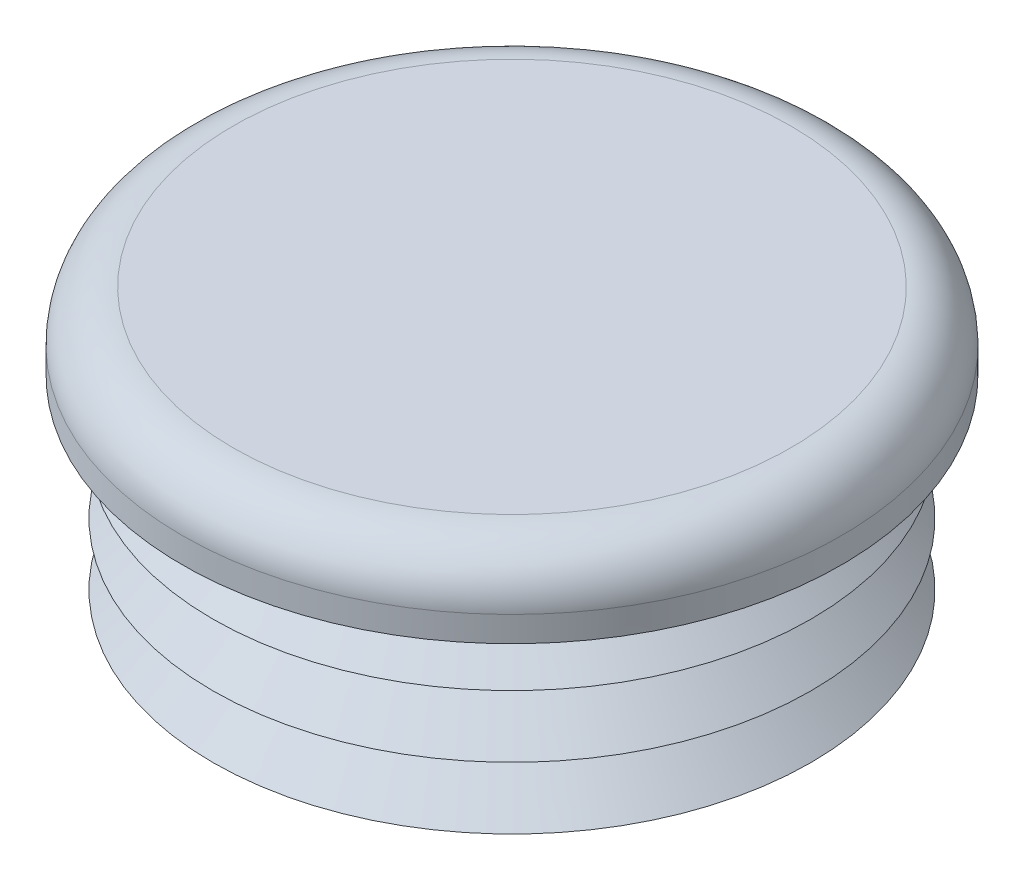
ISO-10303-21;
HEADER;
FILE_DESCRIPTION(('STEP AP214'),'2;1');
FILE_NAME('part.step','',(''),(''),'','','');
FILE_SCHEMA(('AUTOMOTIVE_DESIGN { 1 0 10303 214 1 1 1 1 }'));
ENDSEC;
DATA;
#1=APPLICATION_CONTEXT('core data for automotive mechanical design processes');
#2=APPLICATION_PROTOCOL_DEFINITION('international standard','automotive_design',2000,#1);
#3=PRODUCT_CONTEXT('',#1,'mechanical');
#4=PRODUCT('Part','Part','',(#3));
#5=PRODUCT_RELATED_PRODUCT_CATEGORY('part','',(#4));
#6=PRODUCT_DEFINITION_FORMATION('','',#4);
#7=PRODUCT_DEFINITION_CONTEXT('part definition',#1,'design');
#8=PRODUCT_DEFINITION('design','',#6,#7);
#9=PRODUCT_DEFINITION_SHAPE('','',#8);
#10=(LENGTH_UNIT() NAMED_UNIT(*) SI_UNIT(.MILLI.,.METRE.));
#11=(NAMED_UNIT(*) PLANE_ANGLE_UNIT() SI_UNIT($,.RADIAN.));
#12=(NAMED_UNIT(*) SI_UNIT($,.STERADIAN.) SOLID_ANGLE_UNIT());
#13=UNCERTAINTY_MEASURE_WITH_UNIT(LENGTH_MEASURE(1.E-05),#10,'distance_accuracy_value','');
#14=(GEOMETRIC_REPRESENTATION_CONTEXT(3) GLOBAL_UNCERTAINTY_ASSIGNED_CONTEXT((#13)) GLOBAL_UNIT_ASSIGNED_CONTEXT((#10,
#11,#12)) REPRESENTATION_CONTEXT('',''));
#15=CARTESIAN_POINT('',(0.,0.,0.));
#16=DIRECTION('',(0.,0.,1.));
#17=DIRECTION('',(1.,0.,0.));
#18=AXIS2_PLACEMENT_3D('',#15,#16,#17);
#19=CARTESIAN_POINT('',(0.,12.7,0.));
#20=DIRECTION('',(0.,-1.,0.));
#21=DIRECTION('',(0.,0.,-1.));
#22=AXIS2_PLACEMENT_3D('',#19,#20,#21);
#23=PLANE('',#22);
#24=CARTESIAN_POINT('',(0.,12.7,0.));
#25=DIRECTION('',(0.,-1.,0.));
#26=DIRECTION('',(0.,0.,-1.));
#27=AXIS2_PLACEMENT_3D('',#24,#25,#26);
#28=CIRCLE('',#27,14.9225);
#29=CARTESIAN_POINT('',(0.,12.7,-14.9225));
#30=VERTEX_POINT('',#29);
#31=EDGE_CURVE('E44',#30,#30,#28,.T.);
#32=ORIENTED_EDGE('',*,*,#31,.T.);
#33=EDGE_LOOP('',(#32));
#34=FACE_BOUND('',#33,.T.);
#35=ADVANCED_FACE('F33',(#34),#23,.T.);
#36=CARTESIAN_POINT('',(0.,0.,0.));
#37=DIRECTION('',(0.,-1.,0.));
#38=DIRECTION('',(0.,0.,-1.));
#39=AXIS2_PLACEMENT_3D('',#36,#37,#38);
#40=CYLINDRICAL_SURFACE('',#39,14.9225);
#41=CARTESIAN_POINT('',(0.,0.,0.));
#42=DIRECTION('',(0.,-1.,0.));
#43=DIRECTION('',(0.,0.,-1.));
#44=AXIS2_PLACEMENT_3D('',#41,#42,#43);
#45=CIRCLE('',#44,14.9225);
#46=CARTESIAN_POINT('',(0.,0.,-14.9225));
#47=VERTEX_POINT('',#46);
#48=EDGE_CURVE('E48',#47,#47,#45,.T.);
#49=ORIENTED_EDGE('',*,*,#48,.T.);
#50=EDGE_LOOP('',(#49));
#51=FACE_BOUND('',#50,.T.);
#52=ORIENTED_EDGE('',*,*,#31,.F.);
#53=EDGE_LOOP('',(#52));
#54=FACE_BOUND('',#53,.T.);
#55=ADVANCED_FACE('F105',(#51,#54),#40,.F.);
#56=CARTESIAN_POINT('',(14.9225,0.,0.));
#57=DIRECTION('',(0.,-1.,0.));
#58=DIRECTION('',(0.,0.,-1.));
#59=AXIS2_PLACEMENT_3D('',#56,#57,#58);
#60=PLANE('',#59);
#61=CARTESIAN_POINT('',(0.,0.,0.));
#62=DIRECTION('',(0.,-1.,0.));
#63=DIRECTION('',(0.,0.,-1.));
#64=AXIS2_PLACEMENT_3D('',#61,#62,#63);
#65=CIRCLE('',#64,15.875);
#66=CARTESIAN_POINT('',(0.,0.,-15.875));
#67=VERTEX_POINT('',#66);
#68=EDGE_CURVE('E53',#67,#67,#65,.T.);
#69=ORIENTED_EDGE('',*,*,#68,.T.);
#70=EDGE_LOOP('',(#69));
#71=FACE_BOUND('',#70,.T.);
#72=ORIENTED_EDGE('',*,*,#48,.F.);
#73=EDGE_LOOP('',(#72));
#74=FACE_BOUND('',#73,.T.);
#75=ADVANCED_FACE('F110',(#71,#74),#60,.T.);
#76=CARTESIAN_POINT('',(0.,0.,0.));
#77=DIRECTION('',(0.,-1.,0.));
#78=DIRECTION('',(0.,0.,-1.));
#79=AXIS2_PLACEMENT_3D('',#76,#77,#78);
#80=CYLINDRICAL_SURFACE('',#79,15.875);
#81=CARTESIAN_POINT('',(0.,1.03187500000004,0.));
#82=DIRECTION('',(0.,-1.,0.));
#83=DIRECTION('',(0.,0.,-1.));
#84=AXIS2_PLACEMENT_3D('',#81,#82,#83);
#85=CIRCLE('',#84,15.875);
#86=CARTESIAN_POINT('',(0.,1.03187500000004,-15.875));
#87=VERTEX_POINT('',#86);
#88=EDGE_CURVE('E56',#87,#87,#85,.T.);
#89=ORIENTED_EDGE('',*,*,#88,.T.);
#90=EDGE_LOOP('',(#89));
#91=FACE_BOUND('',#90,.T.);
#92=ORIENTED_EDGE('',*,*,#68,.F.);
#93=EDGE_LOOP('',(#92));
#94=FACE_BOUND('',#93,.T.);
#95=ADVANCED_FACE('F116',(#91,#94),#80,.T.);
#96=CARTESIAN_POINT('',(15.875,1.03187500000004,0.));
#97=DIRECTION('',(0.,-1.,0.));
#98=DIRECTION('',(0.,0.,-1.));
#99=AXIS2_PLACEMENT_3D('',#96,#97,#98);
#100=PLANE('',#99);
#101=CARTESIAN_POINT('',(0.,1.03187500000004,0.));
#102=DIRECTION('',(0.,-1.,0.));
#103=DIRECTION('',(0.,0.,-1.));
#104=AXIS2_PLACEMENT_3D('',#101,#102,#103);
#105=CIRCLE('',#104,18.7325);
#106=CARTESIAN_POINT('',(0.,1.03187500000004,-18.7325));
#107=VERTEX_POINT('',#106);
#108=EDGE_CURVE('E59',#107,#107,#105,.T.);
#109=ORIENTED_EDGE('',*,*,#108,.T.);
#110=EDGE_LOOP('',(#109));
#111=FACE_BOUND('',#110,.T.);
#112=ORIENTED_EDGE('',*,*,#88,.F.);
#113=EDGE_LOOP('',(#112));
#114=FACE_BOUND('',#113,.T.);
#115=ADVANCED_FACE('F120',(#111,#114),#100,.T.);
#116=CARTESIAN_POINT('',(0.,1.03187500000004,0.));
#117=DIRECTION('',(0.,-1.,0.));
#118=DIRECTION('',(0.,0.,-1.));
#119=AXIS2_PLACEMENT_3D('',#116,#117,#118);
#120=CONICAL_SURFACE('',#119,18.7325,0.785398163397457);
#121=CARTESIAN_POINT('',(0.,3.88937499999999,0.));
#122=DIRECTION('',(0.,-1.,0.));
#123=DIRECTION('',(0.,0.,-1.));
#124=AXIS2_PLACEMENT_3D('',#121,#122,#123);
#125=CIRCLE('',#124,15.875);
#126=CARTESIAN_POINT('',(0.,3.88937499999999,-15.875));
#127=VERTEX_POINT('',#126);
#128=EDGE_CURVE('E62',#127,#127,#125,.T.);
#129=ORIENTED_EDGE('',*,*,#128,.T.);
#130=EDGE_LOOP('',(#129));
#131=FACE_BOUND('',#130,.T.);
#132=ORIENTED_EDGE('',*,*,#108,.F.);
#133=EDGE_LOOP('',(#132));
#134=FACE_BOUND('',#133,.T.);
#135=ADVANCED_FACE('F124',(#131,#134),#120,.T.);
#136=CARTESIAN_POINT('',(0.,0.,0.));
#137=DIRECTION('',(0.,-1.,0.));
#138=DIRECTION('',(0.,0.,-1.));
#139=AXIS2_PLACEMENT_3D('',#136,#137,#138);
#140=CYLINDRICAL_SURFACE('',#139,15.875);
#141=CARTESIAN_POINT('',(0.,4.92125000000002,0.));
#142=DIRECTION('',(0.,-1.,0.));
#143=DIRECTION('',(0.,0.,-1.));
#144=AXIS2_PLACEMENT_3D('',#141,#142,#143);
#145=CIRCLE('',#144,15.875);
#146=CARTESIAN_POINT('',(0.,4.92125000000002,-15.875));
#147=VERTEX_POINT('',#146);
#148=EDGE_CURVE('E65',#147,#147,#145,.T.);
#149=ORIENTED_EDGE('',*,*,#148,.T.);
#150=EDGE_LOOP('',(#149));
#151=FACE_BOUND('',#150,.T.);
#152=ORIENTED_EDGE('',*,*,#128,.F.);
#153=EDGE_LOOP('',(#152));
#154=FACE_BOUND('',#153,.T.);
#155=ADVANCED_FACE('F128',(#151,#154),#140,.T.);
#156=CARTESIAN_POINT('',(15.875,4.92125000000002,0.));
#157=DIRECTION('',(0.,-1.,0.));
#158=DIRECTION('',(0.,0.,-1.));
#159=AXIS2_PLACEMENT_3D('',#156,#157,#158);
#160=PLANE('',#159);
#161=CARTESIAN_POINT('',(0.,4.92125000000002,0.));
#162=DIRECTION('',(0.,-1.,0.));
#163=DIRECTION('',(0.,0.,-1.));
#164=AXIS2_PLACEMENT_3D('',#161,#162,#163);
#165=CIRCLE('',#164,18.7325);
#166=CARTESIAN_POINT('',(0.,4.92125000000002,-18.7325));
#167=VERTEX_POINT('',#166);
#168=EDGE_CURVE('E68',#167,#167,#165,.T.);
#169=ORIENTED_EDGE('',*,*,#168,.T.);
#170=EDGE_LOOP('',(#169));
#171=FACE_BOUND('',#170,.T.);
#172=ORIENTED_EDGE('',*,*,#148,.F.);
#173=EDGE_LOOP('',(#172));
#174=FACE_BOUND('',#173,.T.);
#175=ADVANCED_FACE('F132',(#171,#174),#160,.T.);
#176=CARTESIAN_POINT('',(0.,4.92125000000002,0.));
#177=DIRECTION('',(0.,-1.,0.));
#178=DIRECTION('',(0.,0.,-1.));
#179=AXIS2_PLACEMENT_3D('',#176,#177,#178);
#180=CONICAL_SURFACE('',#179,18.7325,0.785398163397457);
#181=CARTESIAN_POINT('',(0.,7.77874999999998,0.));
#182=DIRECTION('',(0.,-1.,0.));
#183=DIRECTION('',(0.,0.,-1.));
#184=AXIS2_PLACEMENT_3D('',#181,#182,#183);
#185=CIRCLE('',#184,15.875);
#186=CARTESIAN_POINT('',(0.,7.77874999999998,-15.875));
#187=VERTEX_POINT('',#186);
#188=EDGE_CURVE('E71',#187,#187,#185,.T.);
#189=ORIENTED_EDGE('',*,*,#188,.T.);
#190=EDGE_LOOP('',(#189));
#191=FACE_BOUND('',#190,.T.);
#192=ORIENTED_EDGE('',*,*,#168,.F.);
#193=EDGE_LOOP('',(#192));
#194=FACE_BOUND('',#193,.T.);
#195=ADVANCED_FACE('F136',(#191,#194),#180,.T.);
#196=CARTESIAN_POINT('',(0.,0.,0.));
#197=DIRECTION('',(0.,-1.,0.));
#198=DIRECTION('',(0.,0.,-1.));
#199=AXIS2_PLACEMENT_3D('',#196,#197,#198);
#200=CYLINDRICAL_SURFACE('',#199,15.875);
#201=CARTESIAN_POINT('',(0.,8.81062500000001,0.));
#202=DIRECTION('',(0.,-1.,0.));
#203=DIRECTION('',(0.,0.,-1.));
#204=AXIS2_PLACEMENT_3D('',#201,#202,#203);
#205=CIRCLE('',#204,15.875);
#206=CARTESIAN_POINT('',(0.,8.81062500000001,-15.875));
#207=VERTEX_POINT('',#206);
#208=EDGE_CURVE('E74',#207,#207,#205,.T.);
#209=ORIENTED_EDGE('',*,*,#208,.T.);
#210=EDGE_LOOP('',(#209));
#211=FACE_BOUND('',#210,.T.);
#212=ORIENTED_EDGE('',*,*,#188,.F.);
#213=EDGE_LOOP('',(#212));
#214=FACE_BOUND('',#213,.T.);
#215=ADVANCED_FACE('F140',(#211,#214),#200,.T.);
#216=CARTESIAN_POINT('',(15.875,8.81062500000001,0.));
#217=DIRECTION('',(0.,-1.,0.));
#218=DIRECTION('',(0.,0.,-1.));
#219=AXIS2_PLACEMENT_3D('',#216,#217,#218);
#220=PLANE('',#219);
#221=CARTESIAN_POINT('',(0.,8.81062500000001,0.));
#222=DIRECTION('',(0.,-1.,0.));
#223=DIRECTION('',(0.,0.,-1.));
#224=AXIS2_PLACEMENT_3D('',#221,#222,#223);
#225=CIRCLE('',#224,18.7325);
#226=CARTESIAN_POINT('',(0.,8.81062500000001,-18.7325));
#227=VERTEX_POINT('',#226);
#228=EDGE_CURVE('E77',#227,#227,#225,.T.);
#229=ORIENTED_EDGE('',*,*,#228,.T.);
#230=EDGE_LOOP('',(#229));
#231=FACE_BOUND('',#230,.T.);
#232=ORIENTED_EDGE('',*,*,#208,.F.);
#233=EDGE_LOOP('',(#232));
#234=FACE_BOUND('',#233,.T.);
#235=ADVANCED_FACE('F144',(#231,#234),#220,.T.);
#236=CARTESIAN_POINT('',(0.,8.81062500000001,0.));
#237=DIRECTION('',(0.,-1.,0.));
#238=DIRECTION('',(0.,0.,-1.));
#239=AXIS2_PLACEMENT_3D('',#236,#237,#238);
#240=CONICAL_SURFACE('',#239,18.7325,0.785398163397457);
#241=CARTESIAN_POINT('',(0.,11.668125,0.));
#242=DIRECTION('',(0.,-1.,0.));
#243=DIRECTION('',(0.,0.,-1.));
#244=AXIS2_PLACEMENT_3D('',#241,#242,#243);
#245=CIRCLE('',#244,15.875);
#246=CARTESIAN_POINT('',(0.,11.668125,-15.875));
#247=VERTEX_POINT('',#246);
#248=EDGE_CURVE('E80',#247,#247,#245,.T.);
#249=ORIENTED_EDGE('',*,*,#248,.T.);
#250=EDGE_LOOP('',(#249));
#251=FACE_BOUND('',#250,.T.);
#252=ORIENTED_EDGE('',*,*,#228,.F.);
#253=EDGE_LOOP('',(#252));
#254=FACE_BOUND('',#253,.T.);
#255=ADVANCED_FACE('F148',(#251,#254),#240,.T.);
#256=CARTESIAN_POINT('',(0.,0.,0.));
#257=DIRECTION('',(0.,-1.,0.));
#258=DIRECTION('',(0.,0.,-1.));
#259=AXIS2_PLACEMENT_3D('',#256,#257,#258);
#260=CYLINDRICAL_SURFACE('',#259,15.875);
#261=CARTESIAN_POINT('',(0.,12.7,0.));
#262=DIRECTION('',(0.,-1.,0.));
#263=DIRECTION('',(0.,0.,-1.));
#264=AXIS2_PLACEMENT_3D('',#261,#262,#263);
#265=CIRCLE('',#264,15.875);
#266=CARTESIAN_POINT('',(0.,12.7,-15.875));
#267=VERTEX_POINT('',#266);
#268=EDGE_CURVE('E83',#267,#267,#265,.T.);
#269=ORIENTED_EDGE('',*,*,#268,.T.);
#270=EDGE_LOOP('',(#269));
#271=FACE_BOUND('',#270,.T.);
#272=ORIENTED_EDGE('',*,*,#248,.F.);
#273=EDGE_LOOP('',(#272));
#274=FACE_BOUND('',#273,.T.);
#275=ADVANCED_FACE('F102',(#271,#274),#260,.T.);
#276=CARTESIAN_POINT('',(15.875,12.7,0.));
#277=DIRECTION('',(0.,-1.,0.));
#278=DIRECTION('',(0.,0.,-1.));
#279=AXIS2_PLACEMENT_3D('',#276,#277,#278);
#280=PLANE('',#279);
#281=CARTESIAN_POINT('',(0.,12.7,0.));
#282=DIRECTION('',(0.,-1.,0.));
#283=DIRECTION('',(0.,0.,-1.));
#284=AXIS2_PLACEMENT_3D('',#281,#282,#283);
#285=CIRCLE('',#284,20.6375);
#286=CARTESIAN_POINT('',(0.,12.7,-20.6375));
#287=VERTEX_POINT('',#286);
#288=EDGE_CURVE('E86',#287,#287,#285,.T.);
#289=ORIENTED_EDGE('',*,*,#288,.T.);
#290=EDGE_LOOP('',(#289));
#291=FACE_BOUND('',#290,.T.);
#292=ORIENTED_EDGE('',*,*,#268,.F.);
#293=EDGE_LOOP('',(#292));
#294=FACE_BOUND('',#293,.T.);
#295=ADVANCED_FACE('F90',(#291,#294),#280,.T.);
#296=CARTESIAN_POINT('',(0.,0.,0.));
#297=DIRECTION('',(0.,-1.,0.));
#298=DIRECTION('',(0.,0.,-1.));
#299=AXIS2_PLACEMENT_3D('',#296,#297,#298);
#300=CYLINDRICAL_SURFACE('',#299,20.6375);
#301=CARTESIAN_POINT('',(0.,14.2875,0.));
#302=DIRECTION('',(0.,1.,0.));
#303=DIRECTION('',(0.,0.,1.));
#304=AXIS2_PLACEMENT_3D('',#301,#302,#303);
#305=CIRCLE('',#304,20.6375);
#306=CARTESIAN_POINT('',(0.,14.2875,20.6375));
#307=VERTEX_POINT('',#306);
#308=EDGE_CURVE('E40',#307,#307,#305,.F.);
#309=ORIENTED_EDGE('',*,*,#308,.T.);
#310=EDGE_LOOP('',(#309));
#311=FACE_BOUND('',#310,.T.);
#312=ORIENTED_EDGE('',*,*,#288,.F.);
#313=EDGE_LOOP('',(#312));
#314=FACE_BOUND('',#313,.T.);
#315=ADVANCED_FACE('F93',(#311,#314),#300,.T.);
#316=CARTESIAN_POINT('',(20.6375,17.4625,0.));
#317=DIRECTION('',(0.,1.,0.));
#318=DIRECTION('',(0.,0.,1.));
#319=AXIS2_PLACEMENT_3D('',#316,#317,#318);
#320=PLANE('',#319);
#321=CARTESIAN_POINT('',(0.,17.4625,0.));
#322=DIRECTION('',(0.,1.,0.));
#323=DIRECTION('',(0.,0.,1.));
#324=AXIS2_PLACEMENT_3D('',#321,#322,#323);
#325=CIRCLE('',#324,17.4625);
#326=CARTESIAN_POINT('',(0.,17.4625,17.4625));
#327=VERTEX_POINT('',#326);
#328=EDGE_CURVE('E10',#327,#327,#325,.T.);
#329=ORIENTED_EDGE('',*,*,#328,.T.);
#330=EDGE_LOOP('',(#329));
#331=FACE_BOUND('',#330,.T.);
#332=ADVANCED_FACE('F95',(#331),#320,.T.);
#333=CARTESIAN_POINT('',(0.,14.2875,0.));
#334=DIRECTION('',(0.,1.,0.));
#335=DIRECTION('',(0.,0.,1.));
#336=AXIS2_PLACEMENT_3D('',#333,#334,#335);
#337=TOROIDAL_SURFACE('',#336,17.4625,3.175);
#338=ORIENTED_EDGE('',*,*,#328,.F.);
#339=EDGE_LOOP('',(#338));
#340=FACE_BOUND('',#339,.T.);
#341=ORIENTED_EDGE('',*,*,#308,.F.);
#342=EDGE_LOOP('',(#341));
#343=FACE_BOUND('',#342,.T.);
#344=ADVANCED_FACE('F35',(#340,#343),#337,.T.);
#345=CLOSED_SHELL('',(#35,#55,#75,#95,#115,#135,#155,#175,#195,#215,#235,#255,#275,#295,#315,
#332,#344));
#346=MANIFOLD_SOLID_BREP('B2',#345);
#347=ADVANCED_BREP_SHAPE_REPRESENTATION('',(#18,#346),#14);
#348=SHAPE_DEFINITION_REPRESENTATION(#9,#347);
ENDSEC;
END-ISO-10303-21;
